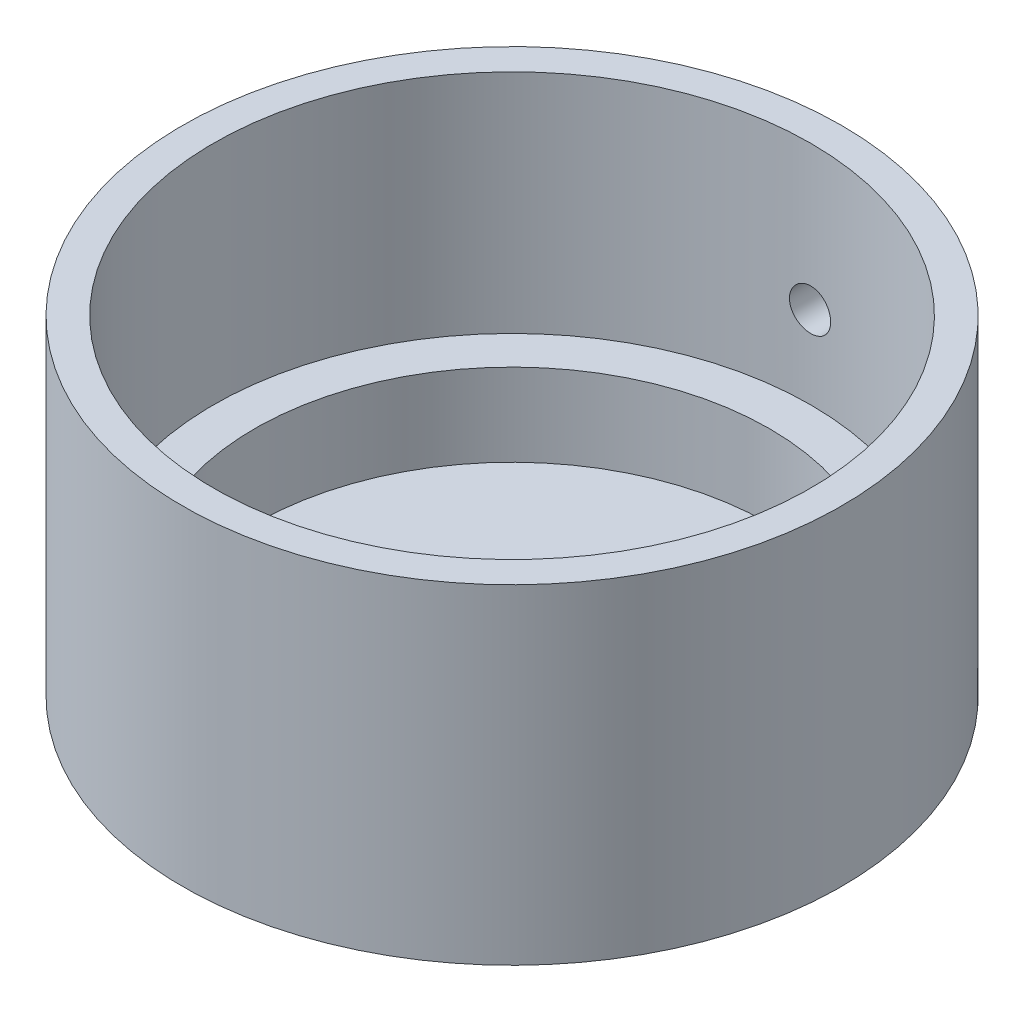
ISO-10303-21;
HEADER;
FILE_DESCRIPTION(('STEP AP214'),'2;1');
FILE_NAME('part.step','',(''),(''),'','','');
FILE_SCHEMA(('AUTOMOTIVE_DESIGN { 1 0 10303 214 1 1 1 1 }'));
ENDSEC;
DATA;
#1=APPLICATION_CONTEXT('core data for automotive mechanical design processes');
#2=APPLICATION_PROTOCOL_DEFINITION('international standard','automotive_design',2000,#1);
#3=PRODUCT_CONTEXT('',#1,'mechanical');
#4=PRODUCT('Part','Part','',(#3));
#5=PRODUCT_RELATED_PRODUCT_CATEGORY('part','',(#4));
#6=PRODUCT_DEFINITION_FORMATION('','',#4);
#7=PRODUCT_DEFINITION_CONTEXT('part definition',#1,'design');
#8=PRODUCT_DEFINITION('design','',#6,#7);
#9=PRODUCT_DEFINITION_SHAPE('','',#8);
#10=(LENGTH_UNIT() NAMED_UNIT(*) SI_UNIT(.MILLI.,.METRE.));
#11=(NAMED_UNIT(*) PLANE_ANGLE_UNIT() SI_UNIT($,.RADIAN.));
#12=(NAMED_UNIT(*) SI_UNIT($,.STERADIAN.) SOLID_ANGLE_UNIT());
#13=UNCERTAINTY_MEASURE_WITH_UNIT(LENGTH_MEASURE(1.E-05),#10,'distance_accuracy_value','');
#14=(GEOMETRIC_REPRESENTATION_CONTEXT(3) GLOBAL_UNCERTAINTY_ASSIGNED_CONTEXT((#13)) GLOBAL_UNIT_ASSIGNED_CONTEXT((#10,
#11,#12)) REPRESENTATION_CONTEXT('',''));
#15=CARTESIAN_POINT('',(0.,0.,0.));
#16=DIRECTION('',(0.,0.,1.));
#17=DIRECTION('',(1.,0.,0.));
#18=AXIS2_PLACEMENT_3D('',#15,#16,#17);
#19=CARTESIAN_POINT('',(0.,0.,0.));
#20=DIRECTION('',(0.,1.,0.));
#21=DIRECTION('',(0.,0.,1.));
#22=AXIS2_PLACEMENT_3D('',#19,#20,#21);
#23=PLANE('',#22);
#24=CARTESIAN_POINT('',(0.,0.,0.));
#25=DIRECTION('',(0.,-1.,0.));
#26=DIRECTION('',(0.,0.,-1.));
#27=AXIS2_PLACEMENT_3D('',#24,#25,#26);
#28=CIRCLE('',#27,12.5);
#29=CARTESIAN_POINT('',(0.,0.,-12.5));
#30=VERTEX_POINT('',#29);
#31=EDGE_CURVE('E10',#30,#30,#28,.T.);
#32=ORIENTED_EDGE('',*,*,#31,.F.);
#33=EDGE_LOOP('',(#32));
#34=FACE_BOUND('',#33,.T.);
#35=ADVANCED_FACE('F33',(#34),#23,.T.);
#36=CARTESIAN_POINT('',(0.,-1.,0.));
#37=DIRECTION('',(0.,-1.,0.));
#38=DIRECTION('',(0.,0.,-1.));
#39=AXIS2_PLACEMENT_3D('',#36,#37,#38);
#40=CYLINDRICAL_SURFACE('',#39,12.5);
#41=ORIENTED_EDGE('',*,*,#31,.T.);
#42=EDGE_LOOP('',(#41));
#43=FACE_BOUND('',#42,.T.);
#44=CARTESIAN_POINT('',(0.,4.,0.));
#45=DIRECTION('',(0.,-1.,0.));
#46=DIRECTION('',(0.,0.,-1.));
#47=AXIS2_PLACEMENT_3D('',#44,#45,#46);
#48=CIRCLE('',#47,12.5);
#49=CARTESIAN_POINT('',(0.,4.,-12.5));
#50=VERTEX_POINT('',#49);
#51=EDGE_CURVE('E39',#50,#50,#48,.T.);
#52=ORIENTED_EDGE('',*,*,#51,.F.);
#53=EDGE_LOOP('',(#52));
#54=FACE_BOUND('',#53,.T.);
#55=ADVANCED_FACE('F95',(#43,#54),#40,.F.);
#56=CARTESIAN_POINT('',(12.5,4.,0.));
#57=DIRECTION('',(0.,1.,0.));
#58=DIRECTION('',(0.,0.,1.));
#59=AXIS2_PLACEMENT_3D('',#56,#57,#58);
#60=PLANE('',#59);
#61=ORIENTED_EDGE('',*,*,#51,.T.);
#62=EDGE_LOOP('',(#61));
#63=FACE_BOUND('',#62,.T.);
#64=CARTESIAN_POINT('',(0.,4.,0.));
#65=DIRECTION('',(0.,-1.,0.));
#66=DIRECTION('',(0.,0.,-1.));
#67=AXIS2_PLACEMENT_3D('',#64,#65,#66);
#68=CIRCLE('',#67,14.5);
#69=CARTESIAN_POINT('',(0.,4.,-14.5));
#70=VERTEX_POINT('',#69);
#71=EDGE_CURVE('E43',#70,#70,#68,.T.);
#72=ORIENTED_EDGE('',*,*,#71,.F.);
#73=EDGE_LOOP('',(#72));
#74=FACE_BOUND('',#73,.T.);
#75=ADVANCED_FACE('F92',(#63,#74),#60,.T.);
#76=CARTESIAN_POINT('',(0.,-1.,0.));
#77=DIRECTION('',(0.,-1.,0.));
#78=DIRECTION('',(0.,0.,-1.));
#79=AXIS2_PLACEMENT_3D('',#76,#77,#78);
#80=CYLINDRICAL_SURFACE('',#79,14.5);
#81=CARTESIAN_POINT('',(1.,8.,-14.4654761414894));
#82=CARTESIAN_POINT('',(0.999997536276507,7.94390126913971,-14.4654766021384));
#83=CARTESIAN_POINT('',(0.995263530176514,7.88776356231306,-14.4658059876537));
#84=CARTESIAN_POINT('',(0.976447092179914,7.77703913219943,-14.4670880474071));
#85=CARTESIAN_POINT('',(0.962353859850938,7.72245427686438,-14.4680414417255));
#86=CARTESIAN_POINT('',(0.92522648536408,7.61645537930668,-14.4704630193286));
#87=CARTESIAN_POINT('',(0.902197160409347,7.5650396459731,-14.4719309252132));
#88=CARTESIAN_POINT('',(0.847859338454927,7.46681664016758,-14.4752157779215));
#89=CARTESIAN_POINT('',(0.816552701955072,7.42000833531967,-14.4770326462834));
#90=CARTESIAN_POINT('',(0.746487476147608,7.33223150782657,-14.4808143971885));
#91=CARTESIAN_POINT('',(0.707717106473717,7.29127239765573,-14.482779510692));
#92=CARTESIAN_POINT('',(0.623849508404116,7.2164372987659,-14.4866341932948));
#93=CARTESIAN_POINT('',(0.57875201278971,7.18256160935739,-14.4885237591991));
#94=CARTESIAN_POINT('',(0.483456190802755,7.12282523859334,-14.4920165002162));
#95=CARTESIAN_POINT('',(0.433252898815753,7.09697246078352,-14.4936193922661));
#96=CARTESIAN_POINT('',(0.329205340617062,7.05406636246796,-14.496355727313));
#97=CARTESIAN_POINT('',(0.275361120300992,7.03701293106568,-14.4974891762263));
#98=CARTESIAN_POINT('',(0.165651823762835,7.01221604409677,-14.4991573125672));
#99=CARTESIAN_POINT('',(0.10979013090302,7.0044576849517,-14.4996929584084));
#100=CARTESIAN_POINT('',(-0.00244502916887597,6.99842513542773,-14.5001083690001));
#101=CARTESIAN_POINT('',(-0.0588184895519717,7.00015081867971,-14.4999881424896));
#102=CARTESIAN_POINT('',(-0.170375972341055,7.01302510568541,-14.4991061520604));
#103=CARTESIAN_POINT('',(-0.225561854493474,7.02415767961686,-14.4983454795024));
#104=CARTESIAN_POINT('',(-0.333279789189963,7.05550484554022,-14.4962694690995));
#105=CARTESIAN_POINT('',(-0.385811823328121,7.07571950051179,-14.4949541274082));
#106=CARTESIAN_POINT('',(-0.486782204854614,7.12467508042636,-14.4919149630764));
#107=CARTESIAN_POINT('',(-0.535217030816813,7.15342324588518,-14.4901907938047));
#108=CARTESIAN_POINT('',(-0.626579660016757,7.218624528412,-14.4865279378039));
#109=CARTESIAN_POINT('',(-0.669507387336928,7.25507775167898,-14.4845892481183));
#110=CARTESIAN_POINT('',(-0.748730864609124,7.33474485730439,-14.4807106861676));
#111=CARTESIAN_POINT('',(-0.785012620769667,7.37797265727707,-14.478770819844));
#112=CARTESIAN_POINT('',(-0.849806295161678,7.46991315041684,-14.475112634974));
#113=CARTESIAN_POINT('',(-0.878318209525655,7.51862584631406,-14.4733943165379));
#114=CARTESIAN_POINT('',(-0.926761985248777,7.62016251277465,-14.4703733285161));
#115=CARTESIAN_POINT('',(-0.946693218947238,7.6729867837584,-14.4690706893384));
#116=CARTESIAN_POINT('',(-0.97740000242833,7.7812428657648,-14.4670290008446));
#117=CARTESIAN_POINT('',(-0.988175683517234,7.83667463937936,-14.4662899434459));
#118=CARTESIAN_POINT('',(-1.00024796695926,7.94845004905988,-14.4654602867631));
#119=CARTESIAN_POINT('',(-1.00156403889033,8.00479157286035,-14.4653683555849));
#120=CARTESIAN_POINT('',(-0.99473065167885,8.11689453318998,-14.4658398375359));
#121=CARTESIAN_POINT('',(-0.986581252674678,8.17265597340241,-14.4664032465014));
#122=CARTESIAN_POINT('',(-0.961064444409163,8.28196061393873,-14.4681207040023));
#123=CARTESIAN_POINT('',(-0.943706035267883,8.33550592513784,-14.46927417582));
#124=CARTESIAN_POINT('',(-0.900273073274734,8.43892357278973,-14.4720412927492));
#125=CARTESIAN_POINT('',(-0.874198424227813,8.4887958686986,-14.4736549429392));
#126=CARTESIAN_POINT('',(-0.814023528926327,8.58354113302537,-14.4771638128072));
#127=CARTESIAN_POINT('',(-0.779910256986406,8.62840581142693,-14.4790594876169));
#128=CARTESIAN_POINT('',(-0.704645383299339,8.71177870978551,-14.4829172155233));
#129=CARTESIAN_POINT('',(-0.663493698098994,8.75028685436362,-14.4848792694067));
#130=CARTESIAN_POINT('',(-0.575236252648539,8.81991953905062,-14.4886525847195));
#131=CARTESIAN_POINT('',(-0.528120528258617,8.85103146596327,-14.4904635851836));
#132=CARTESIAN_POINT('',(-0.42932242253258,8.90490218767549,-14.4937269847995));
#133=CARTESIAN_POINT('',(-0.377640074315143,8.92766104304816,-14.4951793865517));
#134=CARTESIAN_POINT('',(-0.271221834240288,8.96415771839414,-14.4975607086853));
#135=CARTESIAN_POINT('',(-0.216488673199731,8.97790346975189,-14.4984900892146));
#136=CARTESIAN_POINT('',(-0.105484660240334,8.9960096926126,-14.4997224966109));
#137=CARTESIAN_POINT('',(-0.049213827364216,9.00037028028933,-14.5000255312311));
#138=CARTESIAN_POINT('',(0.063143516057073,8.99958121340823,-14.4999711235373));
#139=CARTESIAN_POINT('',(0.119230166786776,8.99445127444526,-14.4996150504509));
#140=CARTESIAN_POINT('',(0.229743615312202,8.97486771937155,-14.4982851717987));
#141=CARTESIAN_POINT('',(0.284170410346236,8.9604140877488,-14.4973113652051));
#142=CARTESIAN_POINT('',(0.389821619713911,8.92259805863097,-14.4948554172781));
#143=CARTESIAN_POINT('',(0.44104609379063,8.8992358273941,-14.4933732854315));
#144=CARTESIAN_POINT('',(0.538848446197716,8.84426831384035,-14.4900669294904));
#145=CARTESIAN_POINT('',(0.585426431758863,8.81266322181151,-14.4882427132932));
#146=CARTESIAN_POINT('',(0.672714016444433,8.74203373424279,-14.4844527538883));
#147=CARTESIAN_POINT('',(0.713411957533447,8.7029949459364,-14.482486740805));
#148=CARTESIAN_POINT('',(0.787691676221238,8.61862825327029,-14.4786369922793));
#149=CARTESIAN_POINT('',(0.821271715161963,8.57329881678608,-14.4767532770284));
#150=CARTESIAN_POINT('',(0.880392928571555,8.47757579529734,-14.4732784578475));
#151=CARTESIAN_POINT('',(0.905922662282559,8.42717513617451,-14.4716877716802));
#152=CARTESIAN_POINT('',(0.948125784329363,8.32282777707472,-14.4689843762455));
#153=CARTESIAN_POINT('',(0.964809492254366,8.26888529188213,-14.4678711103208));
#154=CARTESIAN_POINT('',(0.984534987414964,8.17884665976419,-14.4665388477077));
#155=CARTESIAN_POINT('',(0.990326809576163,8.14333175321176,-14.4661421278976));
#156=CARTESIAN_POINT('',(0.99806010194046,8.07188323258016,-14.4656106274174));
#157=CARTESIAN_POINT('',(1.0000015788222,8.03594961922736,-14.4654758462928));
#158=CARTESIAN_POINT('',(1.,8.,-14.4654761414894));
#159=B_SPLINE_CURVE_WITH_KNOTS('',3,(#81,#82,#83,#84,#85,#86,#87,#88,#89,#90,#91,#92,#93,#94,
#95,#96,#97,#98,#99,#100,#101,#102,#103,#104,#105,#106,#107,#108,#109,#110,#111,#112,#113,#114,
#115,#116,#117,#118,#119,#120,#121,#122,#123,#124,#125,#126,#127,#128,#129,#130,#131,#132,#133,
#134,#135,#136,#137,#138,#139,#140,#141,#142,#143,#144,#145,#146,#147,#148,#149,#150,#151,#152,
#153,#154,#155,#156,#157,#158),.UNSPECIFIED.,.T.,.F.,(4,2,2,2,2,2,2,2,2,2,2,2,2,2,2,2,2,2,2,2,2,
2,2,2,2,2,2,2,2,2,2,2,2,2,2,2,2,2,4),(0.,0.168164948572065,0.33652429543516,0.504793010182661,
0.673023935104377,0.841522596776725,1.01002837693457,1.17869963270162,1.34736876268414,
1.51576708764141,1.68416316879814,1.85227287177637,2.02038374052878,2.18863765776395,
2.35689389419795,2.52550043850424,2.69410706673539,2.86272602613025,3.03134256720021,
3.19961196544876,3.36788029461204,3.53598447444697,3.70409050959159,3.87247083786439,
4.04085316273086,4.20952061220599,4.37818683854894,4.54670444146058,4.71521995837397,
4.88338579463115,5.05155191066968,5.21971488843397,5.38787398446672,5.55636203490795,
5.72489119386385,5.89365879111891,6.06222907201288,6.16999401182649,6.27775876471564),.UNSPECIFIED.);
#160=CARTESIAN_POINT('',(1.,8.,-14.4654761414894));
#161=VERTEX_POINT('',#160);
#162=EDGE_CURVE('E58',#161,#161,#159,.T.);
#163=ORIENTED_EDGE('',*,*,#162,.T.);
#164=EDGE_LOOP('',(#163));
#165=FACE_BOUND('',#164,.T.);
#166=ORIENTED_EDGE('',*,*,#71,.T.);
#167=EDGE_LOOP('',(#166));
#168=FACE_BOUND('',#167,.T.);
#169=CARTESIAN_POINT('',(0.,15.,0.));
#170=DIRECTION('',(0.,-1.,0.));
#171=DIRECTION('',(0.,0.,-1.));
#172=AXIS2_PLACEMENT_3D('',#169,#170,#171);
#173=CIRCLE('',#172,14.5);
#174=CARTESIAN_POINT('',(0.,15.,-14.5));
#175=VERTEX_POINT('',#174);
#176=EDGE_CURVE('E47',#175,#175,#173,.T.);
#177=ORIENTED_EDGE('',*,*,#176,.F.);
#178=EDGE_LOOP('',(#177));
#179=FACE_BOUND('',#178,.T.);
#180=ADVANCED_FACE('F88',(#165,#168,#179),#80,.F.);
#181=CARTESIAN_POINT('',(14.5,15.,0.));
#182=DIRECTION('',(0.,1.,0.));
#183=DIRECTION('',(0.,0.,1.));
#184=AXIS2_PLACEMENT_3D('',#181,#182,#183);
#185=PLANE('',#184);
#186=ORIENTED_EDGE('',*,*,#176,.T.);
#187=EDGE_LOOP('',(#186));
#188=FACE_BOUND('',#187,.T.);
#189=CARTESIAN_POINT('',(0.,15.,0.));
#190=DIRECTION('',(0.,-1.,0.));
#191=DIRECTION('',(0.,0.,-1.));
#192=AXIS2_PLACEMENT_3D('',#189,#190,#191);
#193=CIRCLE('',#192,16.);
#194=CARTESIAN_POINT('',(0.,15.,-16.));
#195=VERTEX_POINT('',#194);
#196=EDGE_CURVE('E52',#195,#195,#193,.T.);
#197=ORIENTED_EDGE('',*,*,#196,.F.);
#198=EDGE_LOOP('',(#197));
#199=FACE_BOUND('',#198,.T.);
#200=ADVANCED_FACE('F84',(#188,#199),#185,.T.);
#201=CARTESIAN_POINT('',(0.,-1.,0.));
#202=DIRECTION('',(0.,-1.,0.));
#203=DIRECTION('',(0.,0.,-1.));
#204=AXIS2_PLACEMENT_3D('',#201,#202,#203);
#205=CYLINDRICAL_SURFACE('',#204,16.);
#206=CARTESIAN_POINT('',(1.,8.,-15.9687194226713));
#207=CARTESIAN_POINT('',(0.999997530979189,8.0561115527194,-15.9687198411353));
#208=CARTESIAN_POINT('',(0.995261369841746,8.11226239486399,-15.969018353808));
#209=CARTESIAN_POINT('',(0.976435871032847,8.2230136144157,-15.9701802900617));
#210=CARTESIAN_POINT('',(0.962335646645886,8.27761210991725,-15.9710443711589));
#211=CARTESIAN_POINT('',(0.925188610022269,8.38363835911096,-15.9732391891673));
#212=CARTESIAN_POINT('',(0.902146520267138,8.43506776991059,-15.9745696797169));
#213=CARTESIAN_POINT('',(0.847777472120561,8.53331542943449,-15.9775470893317));
#214=CARTESIAN_POINT('',(0.816452410807397,8.58013473066297,-15.979193935917));
#215=CARTESIAN_POINT('',(0.74635498971825,8.66791696454848,-15.9826212975974));
#216=CARTESIAN_POINT('',(0.707572812898322,8.70887205177236,-15.9844019869887));
#217=CARTESIAN_POINT('',(0.623682287801145,8.78369615667658,-15.9878947691017));
#218=CARTESIAN_POINT('',(0.578573675788046,8.81756487879444,-15.9896068589598));
#219=CARTESIAN_POINT('',(0.483266707160286,8.8772787727135,-15.9927710231964));
#220=CARTESIAN_POINT('',(0.433064295342439,8.90311748423318,-15.9942228878238));
#221=CARTESIAN_POINT('',(0.329023233776071,8.94599651927326,-15.9967011782085));
#222=CARTESIAN_POINT('',(0.275184622955804,8.96303693696915,-15.9977276085194));
#223=CARTESIAN_POINT('',(0.165474748764173,8.98781398599598,-15.9992381746231));
#224=CARTESIAN_POINT('',(0.109606260323202,8.99556286020663,-15.9997230239649));
#225=CARTESIAN_POINT('',(-0.00264039663577914,9.001574667358,-16.0000981990362));
#226=CARTESIAN_POINT('',(-0.0590185594017615,8.99983770721983,-15.9999885314668));
#227=CARTESIAN_POINT('',(-0.170601268404246,8.98693725252608,-15.9991876257094));
#228=CARTESIAN_POINT('',(-0.225807343941722,8.97578692825015,-15.9984972000676));
#229=CARTESIAN_POINT('',(-0.333562690243542,8.94439669965011,-15.9966134446114));
#230=CARTESIAN_POINT('',(-0.386111945300424,8.9241567415939,-15.9954201118241));
#231=CARTESIAN_POINT('',(-0.487104243384538,8.87514687075318,-15.9926635052552));
#232=CARTESIAN_POINT('',(-0.535544382664922,8.84637098949541,-15.991099972778));
#233=CARTESIAN_POINT('',(-0.626911698437902,8.78111045725255,-15.9877789297274));
#234=CARTESIAN_POINT('',(-0.669838812883486,8.74462571951941,-15.9860214169712));
#235=CARTESIAN_POINT('',(-0.749038406115801,8.6649087591158,-15.9825066607318));
#236=CARTESIAN_POINT('',(-0.785299380057093,8.62166510503306,-15.9807494228481));
#237=CARTESIAN_POINT('',(-0.850048671499497,8.5296978917104,-15.9774363321876));
#238=CARTESIAN_POINT('',(-0.878536985907494,8.48097433028978,-15.975880479491));
#239=CARTESIAN_POINT('',(-0.926931459210992,8.37942307421925,-15.9731458545621));
#240=CARTESIAN_POINT('',(-0.946837133512336,8.32659514802686,-15.9719671036228));
#241=CARTESIAN_POINT('',(-0.97749333362007,8.21833810776506,-15.9701203713367));
#242=CARTESIAN_POINT('',(-0.988243967125888,8.16290902430362,-15.9694523839814));
#243=CARTESIAN_POINT('',(-1.00027058075806,8.05112345412102,-15.9687036349613));
#244=CARTESIAN_POINT('',(-1.00156255318282,7.99476869430265,-15.9686218821213));
#245=CARTESIAN_POINT('',(-0.994676954357525,7.88264326168271,-15.969052232218));
#246=CARTESIAN_POINT('',(-0.986499432380862,7.82687258584346,-15.9695643320648));
#247=CARTESIAN_POINT('',(-0.960920259294965,7.71754367170745,-15.9711237717849));
#248=CARTESIAN_POINT('',(-0.943525973475455,7.66398370357816,-15.9721706842554));
#249=CARTESIAN_POINT('',(-0.900014493620536,7.56054318523046,-15.9746814071507));
#250=CARTESIAN_POINT('',(-0.873897220477942,7.51066266838532,-15.9761452213563));
#251=CARTESIAN_POINT('',(-0.813640273406213,7.41592351932971,-15.9793271925999));
#252=CARTESIAN_POINT('',(-0.779489883827754,7.37107171413249,-15.9810456882235));
#253=CARTESIAN_POINT('',(-0.704151704361529,7.28773194013871,-15.9845421781084));
#254=CARTESIAN_POINT('',(-0.66296384556227,7.24924403366524,-15.9863201729523));
#255=CARTESIAN_POINT('',(-0.574651072357625,7.17967057054764,-15.9897382037197));
#256=CARTESIAN_POINT('',(-0.527517996495804,7.14859536273744,-15.9913780447267));
#257=CARTESIAN_POINT('',(-0.428693770152174,7.09480022609749,-15.994332187476));
#258=CARTESIAN_POINT('',(-0.377002647786562,7.0720802457332,-15.9956464912261));
#259=CARTESIAN_POINT('',(-0.270567696249643,7.03565850083437,-15.9978005355393));
#260=CARTESIAN_POINT('',(-0.215826115659463,7.02195018648359,-15.9986406207087));
#261=CARTESIAN_POINT('',(-0.104812895574875,7.00391946714205,-15.9997529424787));
#262=CARTESIAN_POINT('',(-0.0485412711395199,6.9995969698077,-16.000025184666));
#263=CARTESIAN_POINT('',(0.0638322529598475,7.00046148232286,-15.9999711621222));
#264=CARTESIAN_POINT('',(0.119934278433169,7.00563229600157,-15.999645916741));
#265=CARTESIAN_POINT('',(0.230471868848109,7.02530307023255,-15.998435518434));
#266=CARTESIAN_POINT('',(0.284907430859812,7.03980304718602,-15.9975503645239));
#267=CARTESIAN_POINT('',(0.390569318288325,7.07771689678164,-15.9953196405464));
#268=CARTESIAN_POINT('',(0.441795666518811,7.10113070604871,-15.9939740737523));
#269=CARTESIAN_POINT('',(0.539592275878478,7.15620532562038,-15.9909736002392));
#270=CARTESIAN_POINT('',(0.586162657738061,7.18786592200687,-15.9893187015444));
#271=CARTESIAN_POINT('',(0.6734074881143,7.25859519657093,-15.985882362156));
#272=CARTESIAN_POINT('',(0.714072443678589,7.29767557438409,-15.9841007244306));
#273=CARTESIAN_POINT('',(0.788278718736946,7.38211952305774,-15.9806132737751));
#274=CARTESIAN_POINT('',(0.82181829239186,7.42748462929514,-15.9789074795087));
#275=CARTESIAN_POINT('',(0.880846585182559,7.52326214918642,-15.9757624815986));
#276=CARTESIAN_POINT('',(0.906325259723947,7.57368075779323,-15.9743236114818));
#277=CARTESIAN_POINT('',(0.948424563369131,7.67805250761672,-15.9718796544747));
#278=CARTESIAN_POINT('',(0.965055567355717,7.73200142537781,-15.9708740597848));
#279=CARTESIAN_POINT('',(0.984664887060615,7.82190033144963,-15.9696740541119));
#280=CARTESIAN_POINT('',(0.990408117992379,7.85726921253238,-15.9693176670435));
#281=CARTESIAN_POINT('',(0.998076459396095,7.92842006564484,-15.9688402180015));
#282=CARTESIAN_POINT('',(1.00000157518214,7.96420203709955,-15.9687191557003));
#283=CARTESIAN_POINT('',(1.,8.,-15.9687194226713));
#284=B_SPLINE_CURVE_WITH_KNOTS('',3,(#206,#207,#208,#209,#210,#211,#212,#213,#214,#215,#216,
#217,#218,#219,#220,#221,#222,#223,#224,#225,#226,#227,#228,#229,#230,#231,#232,#233,#234,#235,
#236,#237,#238,#239,#240,#241,#242,#243,#244,#245,#246,#247,#248,#249,#250,#251,#252,#253,#254,
#255,#256,#257,#258,#259,#260,#261,#262,#263,#264,#265,#266,#267,#268,#269,#270,#271,#272,#273,
#274,#275,#276,#277,#278,#279,#280,#281,#282,#283),.UNSPECIFIED.,.T.,.F.,(4,2,2,2,2,2,2,2,2,2,2,
2,2,2,2,2,2,2,2,2,2,2,2,2,2,2,2,2,2,2,2,2,2,2,2,2,2,2,4),(0.,0.168203973235825,
0.336603844556244,0.504914899358459,0.673187438624217,0.841683038825125,1.01018566534422,
1.17882350626665,1.3474595420799,1.51587313181256,1.68428482324807,1.85246127888492,
2.02063872868625,2.18893404953364,2.35723126431538,2.52581626474337,2.69440133225935,
2.86299591720155,3.03158851877835,3.1998960052442,3.36820261594567,3.53637493205267,
3.70454877332519,3.87294823249217,4.04134934073538,4.20998419473402,4.37861800858551,
4.54712912090045,4.71563857528899,4.88386080932268,5.05208333910167,5.22030467288373,
5.38852164351148,5.55700609815315,5.72553178684829,5.89426665384357,6.06280322177696,
6.17011388566673,6.27742440020044),.UNSPECIFIED.);
#285=CARTESIAN_POINT('',(1.,8.,-15.9687194226713));
#286=VERTEX_POINT('',#285);
#287=EDGE_CURVE('E65',#286,#286,#284,.T.);
#288=ORIENTED_EDGE('',*,*,#287,.T.);
#289=EDGE_LOOP('',(#288));
#290=FACE_BOUND('',#289,.T.);
#291=ORIENTED_EDGE('',*,*,#196,.T.);
#292=EDGE_LOOP('',(#291));
#293=FACE_BOUND('',#292,.T.);
#294=CARTESIAN_POINT('',(0.,-0.999999999999998,0.));
#295=DIRECTION('',(0.,-1.,0.));
#296=DIRECTION('',(0.,0.,-1.));
#297=AXIS2_PLACEMENT_3D('',#294,#295,#296);
#298=CIRCLE('',#297,16.);
#299=CARTESIAN_POINT('',(0.,-0.999999999999998,-16.));
#300=VERTEX_POINT('',#299);
#301=EDGE_CURVE('E55',#300,#300,#298,.T.);
#302=ORIENTED_EDGE('',*,*,#301,.F.);
#303=EDGE_LOOP('',(#302));
#304=FACE_BOUND('',#303,.T.);
#305=ADVANCED_FACE('F80',(#290,#293,#304),#205,.T.);
#306=CARTESIAN_POINT('',(16.,-0.999999999999999,0.));
#307=DIRECTION('',(0.,-1.,0.));
#308=DIRECTION('',(0.,0.,-1.));
#309=AXIS2_PLACEMENT_3D('',#306,#307,#308);
#310=PLANE('',#309);
#311=ORIENTED_EDGE('',*,*,#301,.T.);
#312=EDGE_LOOP('',(#311));
#313=FACE_BOUND('',#312,.T.);
#314=ADVANCED_FACE('F75',(#313),#310,.T.);
#315=CARTESIAN_POINT('',(0.,8.,-16.001));
#316=DIRECTION('',(0.,0.,1.));
#317=DIRECTION('',(1.,0.,0.));
#318=AXIS2_PLACEMENT_3D('',#315,#316,#317);
#319=CYLINDRICAL_SURFACE('',#318,1.);
#320=ORIENTED_EDGE('',*,*,#162,.F.);
#321=EDGE_LOOP('',(#320));
#322=FACE_BOUND('',#321,.T.);
#323=ORIENTED_EDGE('',*,*,#287,.F.);
#324=EDGE_LOOP('',(#323));
#325=FACE_BOUND('',#324,.T.);
#326=ADVANCED_FACE('F69',(#322,#325),#319,.F.);
#327=CLOSED_SHELL('',(#35,#55,#75,#180,#200,#305,#314,#326));
#328=MANIFOLD_SOLID_BREP('B2',#327);
#329=ADVANCED_BREP_SHAPE_REPRESENTATION('',(#18,#328),#14);
#330=SHAPE_DEFINITION_REPRESENTATION(#9,#329);
ENDSEC;
END-ISO-10303-21;
